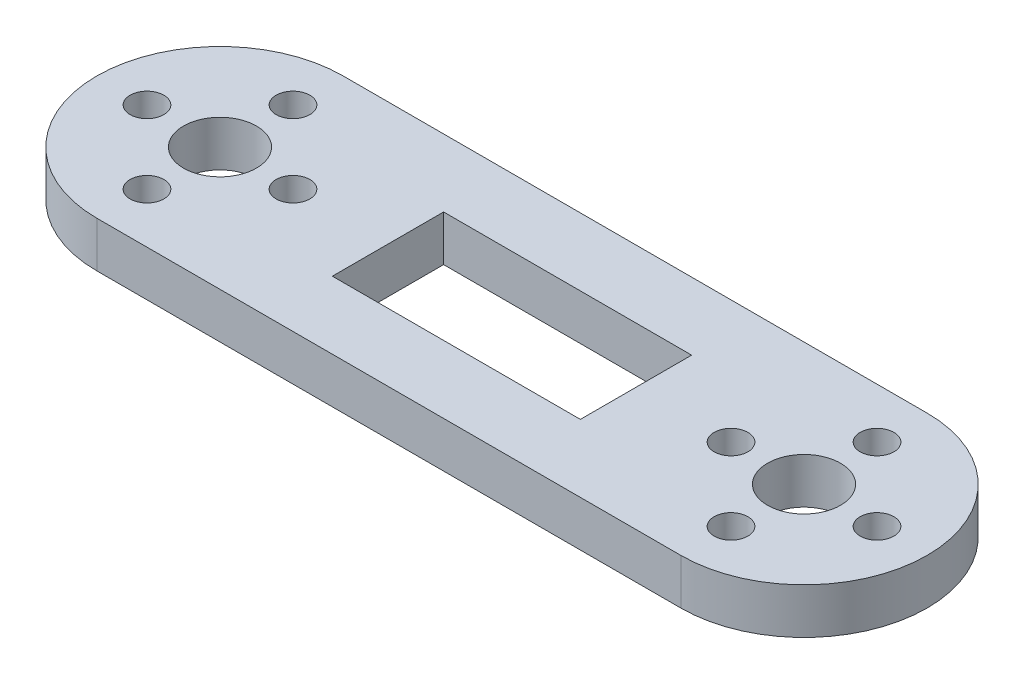
ISO-10303-21;
HEADER;
FILE_DESCRIPTION(('STEP AP214'),'2;1');
FILE_NAME('part.step','',(''),(''),'','','');
FILE_SCHEMA(('AUTOMOTIVE_DESIGN { 1 0 10303 214 1 1 1 1 }'));
ENDSEC;
DATA;
#1=APPLICATION_CONTEXT('core data for automotive mechanical design processes');
#2=APPLICATION_PROTOCOL_DEFINITION('international standard','automotive_design',2000,#1);
#3=PRODUCT_CONTEXT('',#1,'mechanical');
#4=PRODUCT('Part','Part','',(#3));
#5=PRODUCT_RELATED_PRODUCT_CATEGORY('part','',(#4));
#6=PRODUCT_DEFINITION_FORMATION('','',#4);
#7=PRODUCT_DEFINITION_CONTEXT('part definition',#1,'design');
#8=PRODUCT_DEFINITION('design','',#6,#7);
#9=PRODUCT_DEFINITION_SHAPE('','',#8);
#10=(LENGTH_UNIT() NAMED_UNIT(*) SI_UNIT(.MILLI.,.METRE.));
#11=(NAMED_UNIT(*) PLANE_ANGLE_UNIT() SI_UNIT($,.RADIAN.));
#12=(NAMED_UNIT(*) SI_UNIT($,.STERADIAN.) SOLID_ANGLE_UNIT());
#13=UNCERTAINTY_MEASURE_WITH_UNIT(LENGTH_MEASURE(1.E-05),#10,'distance_accuracy_value','');
#14=(GEOMETRIC_REPRESENTATION_CONTEXT(3) GLOBAL_UNCERTAINTY_ASSIGNED_CONTEXT((#13)) GLOBAL_UNIT_ASSIGNED_CONTEXT((#10,
#11,#12)) REPRESENTATION_CONTEXT('',''));
#15=CARTESIAN_POINT('',(0.,0.,0.));
#16=DIRECTION('',(0.,0.,1.));
#17=DIRECTION('',(1.,0.,0.));
#18=AXIS2_PLACEMENT_3D('',#15,#16,#17);
#19=CARTESIAN_POINT('',(0.,5.,0.));
#20=DIRECTION('',(0.,1.,0.));
#21=DIRECTION('',(0.,0.,1.));
#22=AXIS2_PLACEMENT_3D('',#19,#20,#21);
#23=PLANE('',#22);
#24=DIRECTION('',(0.,0.,-1.));
#25=VECTOR('',#24,1.);
#26=CARTESIAN_POINT('',(45.589,5.,6.096));
#27=LINE('',#26,#25);
#28=CARTESIAN_POINT('',(45.589,5.,-6.096));
#29=VERTEX_POINT('',#28);
#30=CARTESIAN_POINT('',(45.589,5.,6.096));
#31=VERTEX_POINT('',#30);
#32=EDGE_CURVE('E184',#29,#31,#27,.F.);
#33=ORIENTED_EDGE('',*,*,#32,.T.);
#34=DIRECTION('',(1.,0.,0.));
#35=VECTOR('',#34,1.);
#36=CARTESIAN_POINT('',(18.411,5.,6.096));
#37=LINE('',#36,#35);
#38=CARTESIAN_POINT('',(18.411,5.,6.096));
#39=VERTEX_POINT('',#38);
#40=EDGE_CURVE('E189',#31,#39,#37,.F.);
#41=ORIENTED_EDGE('',*,*,#40,.T.);
#42=DIRECTION('',(0.,0.,1.));
#43=VECTOR('',#42,1.);
#44=CARTESIAN_POINT('',(18.411,5.,-6.096));
#45=LINE('',#44,#43);
#46=CARTESIAN_POINT('',(18.411,5.,-6.096));
#47=VERTEX_POINT('',#46);
#48=EDGE_CURVE('E192',#39,#47,#45,.F.);
#49=ORIENTED_EDGE('',*,*,#48,.T.);
#50=DIRECTION('',(-1.,0.,0.));
#51=VECTOR('',#50,1.);
#52=CARTESIAN_POINT('',(45.589,5.,-6.096));
#53=LINE('',#52,#51);
#54=EDGE_CURVE('E148',#47,#29,#53,.F.);
#55=ORIENTED_EDGE('',*,*,#54,.T.);
#56=EDGE_LOOP('',(#33,#41,#49,#55));
#57=FACE_BOUND('',#56,.T.);
#58=CARTESIAN_POINT('',(56.,5.,0.));
#59=DIRECTION('',(0.,1.,0.));
#60=DIRECTION('',(0.,0.,1.));
#61=AXIS2_PLACEMENT_3D('',#58,#59,#60);
#62=CIRCLE('',#61,1.85);
#63=CARTESIAN_POINT('',(56.,5.,1.85));
#64=VERTEX_POINT('',#63);
#65=EDGE_CURVE('E145',#64,#64,#62,.F.);
#66=ORIENTED_EDGE('',*,*,#65,.T.);
#67=EDGE_LOOP('',(#66));
#68=FACE_BOUND('',#67,.T.);
#69=CARTESIAN_POINT('',(64.,5.,8.));
#70=DIRECTION('',(0.,1.,0.));
#71=DIRECTION('',(0.,0.,1.));
#72=AXIS2_PLACEMENT_3D('',#69,#70,#71);
#73=CIRCLE('',#72,1.85);
#74=CARTESIAN_POINT('',(64.,5.,9.85));
#75=VERTEX_POINT('',#74);
#76=EDGE_CURVE('E149',#75,#75,#73,.F.);
#77=ORIENTED_EDGE('',*,*,#76,.T.);
#78=EDGE_LOOP('',(#77));
#79=FACE_BOUND('',#78,.T.);
#80=CARTESIAN_POINT('',(72.,5.,0.));
#81=DIRECTION('',(0.,1.,0.));
#82=DIRECTION('',(0.,0.,1.));
#83=AXIS2_PLACEMENT_3D('',#80,#81,#82);
#84=CIRCLE('',#83,1.85);
#85=CARTESIAN_POINT('',(72.,5.,1.85));
#86=VERTEX_POINT('',#85);
#87=EDGE_CURVE('E152',#86,#86,#84,.F.);
#88=ORIENTED_EDGE('',*,*,#87,.T.);
#89=EDGE_LOOP('',(#88));
#90=FACE_BOUND('',#89,.T.);
#91=CARTESIAN_POINT('',(64.,5.,-8.));
#92=DIRECTION('',(0.,1.,0.));
#93=DIRECTION('',(0.,0.,1.));
#94=AXIS2_PLACEMENT_3D('',#91,#92,#93);
#95=CIRCLE('',#94,1.85);
#96=CARTESIAN_POINT('',(64.,5.,-6.15));
#97=VERTEX_POINT('',#96);
#98=EDGE_CURVE('E155',#97,#97,#95,.F.);
#99=ORIENTED_EDGE('',*,*,#98,.T.);
#100=EDGE_LOOP('',(#99));
#101=FACE_BOUND('',#100,.T.);
#102=CARTESIAN_POINT('',(64.,5.,0.));
#103=DIRECTION('',(0.,1.,0.));
#104=DIRECTION('',(0.,0.,1.));
#105=AXIS2_PLACEMENT_3D('',#102,#103,#104);
#106=CIRCLE('',#105,4.);
#107=CARTESIAN_POINT('',(64.,5.,4.));
#108=VERTEX_POINT('',#107);
#109=EDGE_CURVE('E158',#108,#108,#106,.F.);
#110=ORIENTED_EDGE('',*,*,#109,.T.);
#111=EDGE_LOOP('',(#110));
#112=FACE_BOUND('',#111,.T.);
#113=CARTESIAN_POINT('',(-8.,5.,0.));
#114=DIRECTION('',(0.,1.,0.));
#115=DIRECTION('',(0.,0.,1.));
#116=AXIS2_PLACEMENT_3D('',#113,#114,#115);
#117=CIRCLE('',#116,1.85);
#118=CARTESIAN_POINT('',(-8.,5.,1.85));
#119=VERTEX_POINT('',#118);
#120=EDGE_CURVE('E161',#119,#119,#117,.F.);
#121=ORIENTED_EDGE('',*,*,#120,.T.);
#122=EDGE_LOOP('',(#121));
#123=FACE_BOUND('',#122,.T.);
#124=CARTESIAN_POINT('',(0.,5.,8.));
#125=DIRECTION('',(0.,1.,0.));
#126=DIRECTION('',(0.,0.,1.));
#127=AXIS2_PLACEMENT_3D('',#124,#125,#126);
#128=CIRCLE('',#127,1.85);
#129=CARTESIAN_POINT('',(0.,5.,9.85));
#130=VERTEX_POINT('',#129);
#131=EDGE_CURVE('E164',#130,#130,#128,.F.);
#132=ORIENTED_EDGE('',*,*,#131,.T.);
#133=EDGE_LOOP('',(#132));
#134=FACE_BOUND('',#133,.T.);
#135=CARTESIAN_POINT('',(8.,5.,0.));
#136=DIRECTION('',(0.,1.,0.));
#137=DIRECTION('',(0.,0.,1.));
#138=AXIS2_PLACEMENT_3D('',#135,#136,#137);
#139=CIRCLE('',#138,1.85);
#140=CARTESIAN_POINT('',(8.,5.,1.85));
#141=VERTEX_POINT('',#140);
#142=EDGE_CURVE('E167',#141,#141,#139,.F.);
#143=ORIENTED_EDGE('',*,*,#142,.T.);
#144=EDGE_LOOP('',(#143));
#145=FACE_BOUND('',#144,.T.);
#146=CARTESIAN_POINT('',(0.,5.,-8.));
#147=DIRECTION('',(0.,1.,0.));
#148=DIRECTION('',(0.,0.,1.));
#149=AXIS2_PLACEMENT_3D('',#146,#147,#148);
#150=CIRCLE('',#149,1.85);
#151=CARTESIAN_POINT('',(0.,5.,-6.15));
#152=VERTEX_POINT('',#151);
#153=EDGE_CURVE('E170',#152,#152,#150,.F.);
#154=ORIENTED_EDGE('',*,*,#153,.T.);
#155=EDGE_LOOP('',(#154));
#156=FACE_BOUND('',#155,.T.);
#157=CARTESIAN_POINT('',(0.,5.,0.));
#158=DIRECTION('',(0.,1.,0.));
#159=DIRECTION('',(0.,0.,1.));
#160=AXIS2_PLACEMENT_3D('',#157,#158,#159);
#161=CIRCLE('',#160,4.);
#162=CARTESIAN_POINT('',(0.,5.,4.));
#163=VERTEX_POINT('',#162);
#164=EDGE_CURVE('E173',#163,#163,#161,.F.);
#165=ORIENTED_EDGE('',*,*,#164,.T.);
#166=EDGE_LOOP('',(#165));
#167=FACE_BOUND('',#166,.T.);
#168=CARTESIAN_POINT('',(64.,5.,0.));
#169=DIRECTION('',(0.,1.,0.));
#170=DIRECTION('',(0.,0.,1.));
#171=AXIS2_PLACEMENT_3D('',#168,#169,#170);
#172=CIRCLE('',#171,13.5);
#173=CARTESIAN_POINT('',(64.,5.,-13.5));
#174=VERTEX_POINT('',#173);
#175=CARTESIAN_POINT('',(64.,5.,13.5));
#176=VERTEX_POINT('',#175);
#177=EDGE_CURVE('E21',#174,#176,#172,.F.);
#178=ORIENTED_EDGE('',*,*,#177,.F.);
#179=DIRECTION('',(-1.,0.,0.));
#180=VECTOR('',#179,1.);
#181=CARTESIAN_POINT('',(64.,5.,-13.5));
#182=LINE('',#181,#180);
#183=CARTESIAN_POINT('',(0.,5.,-13.5));
#184=VERTEX_POINT('',#183);
#185=EDGE_CURVE('E80',#184,#174,#182,.F.);
#186=ORIENTED_EDGE('',*,*,#185,.F.);
#187=CARTESIAN_POINT('',(0.,5.,0.));
#188=DIRECTION('',(0.,1.,0.));
#189=DIRECTION('',(0.,0.,1.));
#190=AXIS2_PLACEMENT_3D('',#187,#188,#189);
#191=CIRCLE('',#190,13.5);
#192=CARTESIAN_POINT('',(0.,5.,13.5));
#193=VERTEX_POINT('',#192);
#194=EDGE_CURVE('E95',#193,#184,#191,.F.);
#195=ORIENTED_EDGE('',*,*,#194,.F.);
#196=DIRECTION('',(1.,0.,0.));
#197=VECTOR('',#196,1.);
#198=CARTESIAN_POINT('',(0.,5.,13.5));
#199=LINE('',#198,#197);
#200=EDGE_CURVE('E93',#176,#193,#199,.F.);
#201=ORIENTED_EDGE('',*,*,#200,.F.);
#202=EDGE_LOOP('',(#178,#186,#195,#201));
#203=FACE_BOUND('',#202,.T.);
#204=ADVANCED_FACE('F18',(#57,#68,#79,#90,#101,#112,#123,#134,#145,#156,#167,#203),#23,.T.);
#205=CARTESIAN_POINT('',(0.,0.,13.5));
#206=DIRECTION('',(0.,0.,1.));
#207=DIRECTION('',(1.,0.,0.));
#208=AXIS2_PLACEMENT_3D('',#205,#206,#207);
#209=PLANE('',#208);
#210=ORIENTED_EDGE('',*,*,#200,.T.);
#211=DIRECTION('',(0.,1.,0.));
#212=VECTOR('',#211,1.);
#213=CARTESIAN_POINT('',(0.,0.,13.5));
#214=LINE('',#213,#212);
#215=CARTESIAN_POINT('',(0.,0.,13.5));
#216=VERTEX_POINT('',#215);
#217=EDGE_CURVE('E176',#216,#193,#214,.T.);
#218=ORIENTED_EDGE('',*,*,#217,.F.);
#219=DIRECTION('',(1.,0.,0.));
#220=VECTOR('',#219,1.);
#221=CARTESIAN_POINT('',(0.,0.,13.5));
#222=LINE('',#221,#220);
#223=CARTESIAN_POINT('',(64.,0.,13.5));
#224=VERTEX_POINT('',#223);
#225=EDGE_CURVE('E102',#216,#224,#222,.T.);
#226=ORIENTED_EDGE('',*,*,#225,.T.);
#227=DIRECTION('',(0.,1.,0.));
#228=VECTOR('',#227,1.);
#229=CARTESIAN_POINT('',(64.,0.,13.5));
#230=LINE('',#229,#228);
#231=EDGE_CURVE('E89',#176,#224,#230,.F.);
#232=ORIENTED_EDGE('',*,*,#231,.F.);
#233=EDGE_LOOP('',(#210,#218,#226,#232));
#234=FACE_BOUND('',#233,.T.);
#235=ADVANCED_FACE('F101',(#234),#209,.T.);
#236=CARTESIAN_POINT('',(64.,0.,0.));
#237=DIRECTION('',(0.,1.,0.));
#238=DIRECTION('',(0.,0.,1.));
#239=AXIS2_PLACEMENT_3D('',#236,#237,#238);
#240=CYLINDRICAL_SURFACE('',#239,13.5);
#241=ORIENTED_EDGE('',*,*,#177,.T.);
#242=ORIENTED_EDGE('',*,*,#231,.T.);
#243=CARTESIAN_POINT('',(64.,0.,0.));
#244=DIRECTION('',(0.,1.,0.));
#245=DIRECTION('',(0.,0.,1.));
#246=AXIS2_PLACEMENT_3D('',#243,#244,#245);
#247=CIRCLE('',#246,13.5);
#248=CARTESIAN_POINT('',(64.,0.,-13.5));
#249=VERTEX_POINT('',#248);
#250=EDGE_CURVE('E143',#224,#249,#247,.T.);
#251=ORIENTED_EDGE('',*,*,#250,.T.);
#252=DIRECTION('',(0.,1.,0.));
#253=VECTOR('',#252,1.);
#254=CARTESIAN_POINT('',(64.,0.,-13.5));
#255=LINE('',#254,#253);
#256=EDGE_CURVE('E91',#174,#249,#255,.F.);
#257=ORIENTED_EDGE('',*,*,#256,.F.);
#258=EDGE_LOOP('',(#241,#242,#251,#257));
#259=FACE_BOUND('',#258,.T.);
#260=ADVANCED_FACE('F86',(#259),#240,.T.);
#261=CARTESIAN_POINT('',(64.,0.,-13.5));
#262=DIRECTION('',(0.,0.,-1.));
#263=DIRECTION('',(-1.,0.,0.));
#264=AXIS2_PLACEMENT_3D('',#261,#262,#263);
#265=PLANE('',#264);
#266=ORIENTED_EDGE('',*,*,#185,.T.);
#267=ORIENTED_EDGE('',*,*,#256,.T.);
#268=DIRECTION('',(1.,0.,0.));
#269=VECTOR('',#268,1.);
#270=CARTESIAN_POINT('',(0.,0.,-13.5));
#271=LINE('',#270,#269);
#272=CARTESIAN_POINT('',(0.,0.,-13.5));
#273=VERTEX_POINT('',#272);
#274=EDGE_CURVE('E142',#249,#273,#271,.F.);
#275=ORIENTED_EDGE('',*,*,#274,.T.);
#276=DIRECTION('',(0.,1.,0.));
#277=VECTOR('',#276,1.);
#278=CARTESIAN_POINT('',(0.,0.,-13.5));
#279=LINE('',#278,#277);
#280=EDGE_CURVE('E175',#184,#273,#279,.F.);
#281=ORIENTED_EDGE('',*,*,#280,.F.);
#282=EDGE_LOOP('',(#266,#267,#275,#281));
#283=FACE_BOUND('',#282,.T.);
#284=ADVANCED_FACE('F279',(#283),#265,.T.);
#285=CARTESIAN_POINT('',(0.,0.,0.));
#286=DIRECTION('',(0.,1.,0.));
#287=DIRECTION('',(0.,0.,1.));
#288=AXIS2_PLACEMENT_3D('',#285,#286,#287);
#289=CYLINDRICAL_SURFACE('',#288,13.5);
#290=ORIENTED_EDGE('',*,*,#194,.T.);
#291=ORIENTED_EDGE('',*,*,#280,.T.);
#292=CARTESIAN_POINT('',(0.,0.,0.));
#293=DIRECTION('',(0.,1.,0.));
#294=DIRECTION('',(0.,0.,1.));
#295=AXIS2_PLACEMENT_3D('',#292,#293,#294);
#296=CIRCLE('',#295,13.5);
#297=EDGE_CURVE('E139',#273,#216,#296,.T.);
#298=ORIENTED_EDGE('',*,*,#297,.T.);
#299=ORIENTED_EDGE('',*,*,#217,.T.);
#300=EDGE_LOOP('',(#290,#291,#298,#299));
#301=FACE_BOUND('',#300,.T.);
#302=ADVANCED_FACE('F275',(#301),#289,.T.);
#303=CARTESIAN_POINT('',(0.,0.,0.));
#304=DIRECTION('',(0.,1.,0.));
#305=DIRECTION('',(0.,0.,1.));
#306=AXIS2_PLACEMENT_3D('',#303,#304,#305);
#307=CYLINDRICAL_SURFACE('',#306,4.);
#308=CARTESIAN_POINT('',(0.,0.,0.));
#309=DIRECTION('',(0.,1.,0.));
#310=DIRECTION('',(0.,0.,1.));
#311=AXIS2_PLACEMENT_3D('',#308,#309,#310);
#312=CIRCLE('',#311,4.);
#313=CARTESIAN_POINT('',(0.,0.,4.));
#314=VERTEX_POINT('',#313);
#315=EDGE_CURVE('E136',#314,#314,#312,.F.);
#316=ORIENTED_EDGE('',*,*,#315,.T.);
#317=EDGE_LOOP('',(#316));
#318=FACE_BOUND('',#317,.T.);
#319=ORIENTED_EDGE('',*,*,#164,.F.);
#320=EDGE_LOOP('',(#319));
#321=FACE_BOUND('',#320,.T.);
#322=ADVANCED_FACE('F271',(#318,#321),#307,.F.);
#323=CARTESIAN_POINT('',(0.,0.,-8.));
#324=DIRECTION('',(0.,1.,0.));
#325=DIRECTION('',(0.,0.,1.));
#326=AXIS2_PLACEMENT_3D('',#323,#324,#325);
#327=CYLINDRICAL_SURFACE('',#326,1.85);
#328=CARTESIAN_POINT('',(0.,0.,-8.));
#329=DIRECTION('',(0.,1.,0.));
#330=DIRECTION('',(0.,0.,1.));
#331=AXIS2_PLACEMENT_3D('',#328,#329,#330);
#332=CIRCLE('',#331,1.85);
#333=CARTESIAN_POINT('',(0.,0.,-6.15));
#334=VERTEX_POINT('',#333);
#335=EDGE_CURVE('E133',#334,#334,#332,.F.);
#336=ORIENTED_EDGE('',*,*,#335,.T.);
#337=EDGE_LOOP('',(#336));
#338=FACE_BOUND('',#337,.T.);
#339=ORIENTED_EDGE('',*,*,#153,.F.);
#340=EDGE_LOOP('',(#339));
#341=FACE_BOUND('',#340,.T.);
#342=ADVANCED_FACE('F267',(#338,#341),#327,.F.);
#343=CARTESIAN_POINT('',(8.,0.,0.));
#344=DIRECTION('',(0.,1.,0.));
#345=DIRECTION('',(0.,0.,1.));
#346=AXIS2_PLACEMENT_3D('',#343,#344,#345);
#347=CYLINDRICAL_SURFACE('',#346,1.85);
#348=CARTESIAN_POINT('',(8.,0.,0.));
#349=DIRECTION('',(0.,1.,0.));
#350=DIRECTION('',(0.,0.,1.));
#351=AXIS2_PLACEMENT_3D('',#348,#349,#350);
#352=CIRCLE('',#351,1.85);
#353=CARTESIAN_POINT('',(8.,0.,1.85));
#354=VERTEX_POINT('',#353);
#355=EDGE_CURVE('E130',#354,#354,#352,.F.);
#356=ORIENTED_EDGE('',*,*,#355,.T.);
#357=EDGE_LOOP('',(#356));
#358=FACE_BOUND('',#357,.T.);
#359=ORIENTED_EDGE('',*,*,#142,.F.);
#360=EDGE_LOOP('',(#359));
#361=FACE_BOUND('',#360,.T.);
#362=ADVANCED_FACE('F263',(#358,#361),#347,.F.);
#363=CARTESIAN_POINT('',(0.,0.,8.));
#364=DIRECTION('',(0.,1.,0.));
#365=DIRECTION('',(0.,0.,1.));
#366=AXIS2_PLACEMENT_3D('',#363,#364,#365);
#367=CYLINDRICAL_SURFACE('',#366,1.85);
#368=CARTESIAN_POINT('',(0.,0.,8.));
#369=DIRECTION('',(0.,1.,0.));
#370=DIRECTION('',(0.,0.,1.));
#371=AXIS2_PLACEMENT_3D('',#368,#369,#370);
#372=CIRCLE('',#371,1.85);
#373=CARTESIAN_POINT('',(0.,0.,9.85));
#374=VERTEX_POINT('',#373);
#375=EDGE_CURVE('E127',#374,#374,#372,.F.);
#376=ORIENTED_EDGE('',*,*,#375,.T.);
#377=EDGE_LOOP('',(#376));
#378=FACE_BOUND('',#377,.T.);
#379=ORIENTED_EDGE('',*,*,#131,.F.);
#380=EDGE_LOOP('',(#379));
#381=FACE_BOUND('',#380,.T.);
#382=ADVANCED_FACE('F259',(#378,#381),#367,.F.);
#383=CARTESIAN_POINT('',(-8.,0.,0.));
#384=DIRECTION('',(0.,1.,0.));
#385=DIRECTION('',(0.,0.,1.));
#386=AXIS2_PLACEMENT_3D('',#383,#384,#385);
#387=CYLINDRICAL_SURFACE('',#386,1.85);
#388=CARTESIAN_POINT('',(-8.,0.,0.));
#389=DIRECTION('',(0.,1.,0.));
#390=DIRECTION('',(0.,0.,1.));
#391=AXIS2_PLACEMENT_3D('',#388,#389,#390);
#392=CIRCLE('',#391,1.85);
#393=CARTESIAN_POINT('',(-8.,0.,1.85));
#394=VERTEX_POINT('',#393);
#395=EDGE_CURVE('E124',#394,#394,#392,.F.);
#396=ORIENTED_EDGE('',*,*,#395,.T.);
#397=EDGE_LOOP('',(#396));
#398=FACE_BOUND('',#397,.T.);
#399=ORIENTED_EDGE('',*,*,#120,.F.);
#400=EDGE_LOOP('',(#399));
#401=FACE_BOUND('',#400,.T.);
#402=ADVANCED_FACE('F255',(#398,#401),#387,.F.);
#403=CARTESIAN_POINT('',(64.,0.,0.));
#404=DIRECTION('',(0.,1.,0.));
#405=DIRECTION('',(0.,0.,1.));
#406=AXIS2_PLACEMENT_3D('',#403,#404,#405);
#407=CYLINDRICAL_SURFACE('',#406,4.);
#408=ORIENTED_EDGE('',*,*,#109,.F.);
#409=EDGE_LOOP('',(#408));
#410=FACE_BOUND('',#409,.T.);
#411=CARTESIAN_POINT('',(64.,0.,0.));
#412=DIRECTION('',(0.,1.,0.));
#413=DIRECTION('',(0.,0.,1.));
#414=AXIS2_PLACEMENT_3D('',#411,#412,#413);
#415=CIRCLE('',#414,4.);
#416=CARTESIAN_POINT('',(64.,0.,4.));
#417=VERTEX_POINT('',#416);
#418=EDGE_CURVE('E121',#417,#417,#415,.F.);
#419=ORIENTED_EDGE('',*,*,#418,.T.);
#420=EDGE_LOOP('',(#419));
#421=FACE_BOUND('',#420,.T.);
#422=ADVANCED_FACE('F251',(#410,#421),#407,.F.);
#423=CARTESIAN_POINT('',(64.,0.,-8.));
#424=DIRECTION('',(0.,1.,0.));
#425=DIRECTION('',(0.,0.,1.));
#426=AXIS2_PLACEMENT_3D('',#423,#424,#425);
#427=CYLINDRICAL_SURFACE('',#426,1.85);
#428=ORIENTED_EDGE('',*,*,#98,.F.);
#429=EDGE_LOOP('',(#428));
#430=FACE_BOUND('',#429,.T.);
#431=CARTESIAN_POINT('',(64.,0.,-8.));
#432=DIRECTION('',(0.,1.,0.));
#433=DIRECTION('',(0.,0.,1.));
#434=AXIS2_PLACEMENT_3D('',#431,#432,#433);
#435=CIRCLE('',#434,1.85);
#436=CARTESIAN_POINT('',(64.,0.,-6.15));
#437=VERTEX_POINT('',#436);
#438=EDGE_CURVE('E118',#437,#437,#435,.F.);
#439=ORIENTED_EDGE('',*,*,#438,.T.);
#440=EDGE_LOOP('',(#439));
#441=FACE_BOUND('',#440,.T.);
#442=ADVANCED_FACE('F247',(#430,#441),#427,.F.);
#443=CARTESIAN_POINT('',(72.,0.,0.));
#444=DIRECTION('',(0.,1.,0.));
#445=DIRECTION('',(0.,0.,1.));
#446=AXIS2_PLACEMENT_3D('',#443,#444,#445);
#447=CYLINDRICAL_SURFACE('',#446,1.85);
#448=ORIENTED_EDGE('',*,*,#87,.F.);
#449=EDGE_LOOP('',(#448));
#450=FACE_BOUND('',#449,.T.);
#451=CARTESIAN_POINT('',(72.,0.,0.));
#452=DIRECTION('',(0.,1.,0.));
#453=DIRECTION('',(0.,0.,1.));
#454=AXIS2_PLACEMENT_3D('',#451,#452,#453);
#455=CIRCLE('',#454,1.85);
#456=CARTESIAN_POINT('',(72.,0.,1.85));
#457=VERTEX_POINT('',#456);
#458=EDGE_CURVE('E115',#457,#457,#455,.F.);
#459=ORIENTED_EDGE('',*,*,#458,.T.);
#460=EDGE_LOOP('',(#459));
#461=FACE_BOUND('',#460,.T.);
#462=ADVANCED_FACE('F243',(#450,#461),#447,.F.);
#463=CARTESIAN_POINT('',(64.,0.,8.));
#464=DIRECTION('',(0.,1.,0.));
#465=DIRECTION('',(0.,0.,1.));
#466=AXIS2_PLACEMENT_3D('',#463,#464,#465);
#467=CYLINDRICAL_SURFACE('',#466,1.85);
#468=ORIENTED_EDGE('',*,*,#76,.F.);
#469=EDGE_LOOP('',(#468));
#470=FACE_BOUND('',#469,.T.);
#471=CARTESIAN_POINT('',(64.,0.,8.));
#472=DIRECTION('',(0.,1.,0.));
#473=DIRECTION('',(0.,0.,1.));
#474=AXIS2_PLACEMENT_3D('',#471,#472,#473);
#475=CIRCLE('',#474,1.85);
#476=CARTESIAN_POINT('',(64.,0.,9.85));
#477=VERTEX_POINT('',#476);
#478=EDGE_CURVE('E112',#477,#477,#475,.F.);
#479=ORIENTED_EDGE('',*,*,#478,.T.);
#480=EDGE_LOOP('',(#479));
#481=FACE_BOUND('',#480,.T.);
#482=ADVANCED_FACE('F239',(#470,#481),#467,.F.);
#483=CARTESIAN_POINT('',(56.,0.,0.));
#484=DIRECTION('',(0.,1.,0.));
#485=DIRECTION('',(0.,0.,1.));
#486=AXIS2_PLACEMENT_3D('',#483,#484,#485);
#487=CYLINDRICAL_SURFACE('',#486,1.85);
#488=ORIENTED_EDGE('',*,*,#65,.F.);
#489=EDGE_LOOP('',(#488));
#490=FACE_BOUND('',#489,.T.);
#491=CARTESIAN_POINT('',(56.,0.,0.));
#492=DIRECTION('',(0.,1.,0.));
#493=DIRECTION('',(0.,0.,1.));
#494=AXIS2_PLACEMENT_3D('',#491,#492,#493);
#495=CIRCLE('',#494,1.85);
#496=CARTESIAN_POINT('',(56.,0.,1.85));
#497=VERTEX_POINT('',#496);
#498=EDGE_CURVE('E108',#497,#497,#495,.F.);
#499=ORIENTED_EDGE('',*,*,#498,.T.);
#500=EDGE_LOOP('',(#499));
#501=FACE_BOUND('',#500,.T.);
#502=ADVANCED_FACE('F236',(#490,#501),#487,.F.);
#503=CARTESIAN_POINT('',(45.589,5.,-6.096));
#504=DIRECTION('',(0.,0.,-1.));
#505=DIRECTION('',(-1.,0.,0.));
#506=AXIS2_PLACEMENT_3D('',#503,#504,#505);
#507=PLANE('',#506);
#508=DIRECTION('',(0.,1.,0.));
#509=VECTOR('',#508,1.);
#510=CARTESIAN_POINT('',(45.589,5.,-6.096));
#511=LINE('',#510,#509);
#512=CARTESIAN_POINT('',(45.589,0.,-6.096));
#513=VERTEX_POINT('',#512);
#514=EDGE_CURVE('E181',#513,#29,#511,.T.);
#515=ORIENTED_EDGE('',*,*,#514,.T.);
#516=ORIENTED_EDGE('',*,*,#54,.F.);
#517=DIRECTION('',(0.,1.,0.));
#518=VECTOR('',#517,1.);
#519=CARTESIAN_POINT('',(18.411,5.,-6.096));
#520=LINE('',#519,#518);
#521=CARTESIAN_POINT('',(18.411,0.,-6.096));
#522=VERTEX_POINT('',#521);
#523=EDGE_CURVE('E195',#47,#522,#520,.F.);
#524=ORIENTED_EDGE('',*,*,#523,.T.);
#525=DIRECTION('',(1.,0.,0.));
#526=VECTOR('',#525,1.);
#527=CARTESIAN_POINT('',(0.,0.,-6.096));
#528=LINE('',#527,#526);
#529=EDGE_CURVE('E111',#522,#513,#528,.T.);
#530=ORIENTED_EDGE('',*,*,#529,.T.);
#531=EDGE_LOOP('',(#515,#516,#524,#530));
#532=FACE_BOUND('',#531,.T.);
#533=ADVANCED_FACE('F219',(#532),#507,.F.);
#534=CARTESIAN_POINT('',(45.589,5.,6.096));
#535=DIRECTION('',(1.,0.,0.));
#536=DIRECTION('',(0.,0.,-1.));
#537=AXIS2_PLACEMENT_3D('',#534,#535,#536);
#538=PLANE('',#537);
#539=DIRECTION('',(0.,1.,0.));
#540=VECTOR('',#539,1.);
#541=CARTESIAN_POINT('',(45.589,5.,6.096));
#542=LINE('',#541,#540);
#543=CARTESIAN_POINT('',(45.589,0.,6.096));
#544=VERTEX_POINT('',#543);
#545=EDGE_CURVE('E186',#544,#31,#542,.T.);
#546=ORIENTED_EDGE('',*,*,#545,.T.);
#547=ORIENTED_EDGE('',*,*,#32,.F.);
#548=ORIENTED_EDGE('',*,*,#514,.F.);
#549=DIRECTION('',(0.,0.,1.));
#550=VECTOR('',#549,1.);
#551=CARTESIAN_POINT('',(45.589,0.,0.));
#552=LINE('',#551,#550);
#553=EDGE_CURVE('E203',#513,#544,#552,.T.);
#554=ORIENTED_EDGE('',*,*,#553,.T.);
#555=EDGE_LOOP('',(#546,#547,#548,#554));
#556=FACE_BOUND('',#555,.T.);
#557=ADVANCED_FACE('F216',(#556),#538,.F.);
#558=CARTESIAN_POINT('',(18.411,5.,6.096));
#559=DIRECTION('',(0.,0.,1.));
#560=DIRECTION('',(1.,0.,0.));
#561=AXIS2_PLACEMENT_3D('',#558,#559,#560);
#562=PLANE('',#561);
#563=DIRECTION('',(0.,1.,0.));
#564=VECTOR('',#563,1.);
#565=CARTESIAN_POINT('',(18.411,5.,6.096));
#566=LINE('',#565,#564);
#567=CARTESIAN_POINT('',(18.411,0.,6.096));
#568=VERTEX_POINT('',#567);
#569=EDGE_CURVE('E35',#568,#39,#566,.T.);
#570=ORIENTED_EDGE('',*,*,#569,.T.);
#571=ORIENTED_EDGE('',*,*,#40,.F.);
#572=ORIENTED_EDGE('',*,*,#545,.F.);
#573=DIRECTION('',(1.,0.,0.));
#574=VECTOR('',#573,1.);
#575=CARTESIAN_POINT('',(0.,0.,6.096));
#576=LINE('',#575,#574);
#577=EDGE_CURVE('E27',#544,#568,#576,.F.);
#578=ORIENTED_EDGE('',*,*,#577,.T.);
#579=EDGE_LOOP('',(#570,#571,#572,#578));
#580=FACE_BOUND('',#579,.T.);
#581=ADVANCED_FACE('F209',(#580),#562,.F.);
#582=CARTESIAN_POINT('',(18.411,5.,-6.096));
#583=DIRECTION('',(-1.,0.,0.));
#584=DIRECTION('',(0.,0.,1.));
#585=AXIS2_PLACEMENT_3D('',#582,#583,#584);
#586=PLANE('',#585);
#587=ORIENTED_EDGE('',*,*,#523,.F.);
#588=ORIENTED_EDGE('',*,*,#48,.F.);
#589=ORIENTED_EDGE('',*,*,#569,.F.);
#590=DIRECTION('',(0.,0.,1.));
#591=VECTOR('',#590,1.);
#592=CARTESIAN_POINT('',(18.411,0.,0.));
#593=LINE('',#592,#591);
#594=EDGE_CURVE('E11',#568,#522,#593,.F.);
#595=ORIENTED_EDGE('',*,*,#594,.T.);
#596=EDGE_LOOP('',(#587,#588,#589,#595));
#597=FACE_BOUND('',#596,.T.);
#598=ADVANCED_FACE('F221',(#597),#586,.F.);
#599=CARTESIAN_POINT('',(0.,0.,0.));
#600=DIRECTION('',(0.,1.,0.));
#601=DIRECTION('',(0.,0.,1.));
#602=AXIS2_PLACEMENT_3D('',#599,#600,#601);
#603=PLANE('',#602);
#604=ORIENTED_EDGE('',*,*,#577,.F.);
#605=ORIENTED_EDGE('',*,*,#553,.F.);
#606=ORIENTED_EDGE('',*,*,#529,.F.);
#607=ORIENTED_EDGE('',*,*,#594,.F.);
#608=EDGE_LOOP('',(#604,#605,#606,#607));
#609=FACE_BOUND('',#608,.T.);
#610=ORIENTED_EDGE('',*,*,#498,.F.);
#611=EDGE_LOOP('',(#610));
#612=FACE_BOUND('',#611,.T.);
#613=ORIENTED_EDGE('',*,*,#478,.F.);
#614=EDGE_LOOP('',(#613));
#615=FACE_BOUND('',#614,.T.);
#616=ORIENTED_EDGE('',*,*,#458,.F.);
#617=EDGE_LOOP('',(#616));
#618=FACE_BOUND('',#617,.T.);
#619=ORIENTED_EDGE('',*,*,#438,.F.);
#620=EDGE_LOOP('',(#619));
#621=FACE_BOUND('',#620,.T.);
#622=ORIENTED_EDGE('',*,*,#418,.F.);
#623=EDGE_LOOP('',(#622));
#624=FACE_BOUND('',#623,.T.);
#625=ORIENTED_EDGE('',*,*,#395,.F.);
#626=EDGE_LOOP('',(#625));
#627=FACE_BOUND('',#626,.T.);
#628=ORIENTED_EDGE('',*,*,#375,.F.);
#629=EDGE_LOOP('',(#628));
#630=FACE_BOUND('',#629,.T.);
#631=ORIENTED_EDGE('',*,*,#355,.F.);
#632=EDGE_LOOP('',(#631));
#633=FACE_BOUND('',#632,.T.);
#634=ORIENTED_EDGE('',*,*,#335,.F.);
#635=EDGE_LOOP('',(#634));
#636=FACE_BOUND('',#635,.T.);
#637=ORIENTED_EDGE('',*,*,#315,.F.);
#638=EDGE_LOOP('',(#637));
#639=FACE_BOUND('',#638,.T.);
#640=ORIENTED_EDGE('',*,*,#274,.F.);
#641=ORIENTED_EDGE('',*,*,#250,.F.);
#642=ORIENTED_EDGE('',*,*,#225,.F.);
#643=ORIENTED_EDGE('',*,*,#297,.F.);
#644=EDGE_LOOP('',(#640,#641,#642,#643));
#645=FACE_BOUND('',#644,.T.);
#646=ADVANCED_FACE('F213',(#609,#612,#615,#618,#621,#624,#627,#630,#633,#636,#639,#645),#603,.F.);
#647=CLOSED_SHELL('',(#204,#235,#260,#284,#302,#322,#342,#362,#382,#402,#422,#442,#462,#482,
#502,#533,#557,#581,#598,#646));
#648=MANIFOLD_SOLID_BREP('B1',#647);
#649=ADVANCED_BREP_SHAPE_REPRESENTATION('',(#18,#648),#14);
#650=SHAPE_DEFINITION_REPRESENTATION(#9,#649);
ENDSEC;
END-ISO-10303-21;
